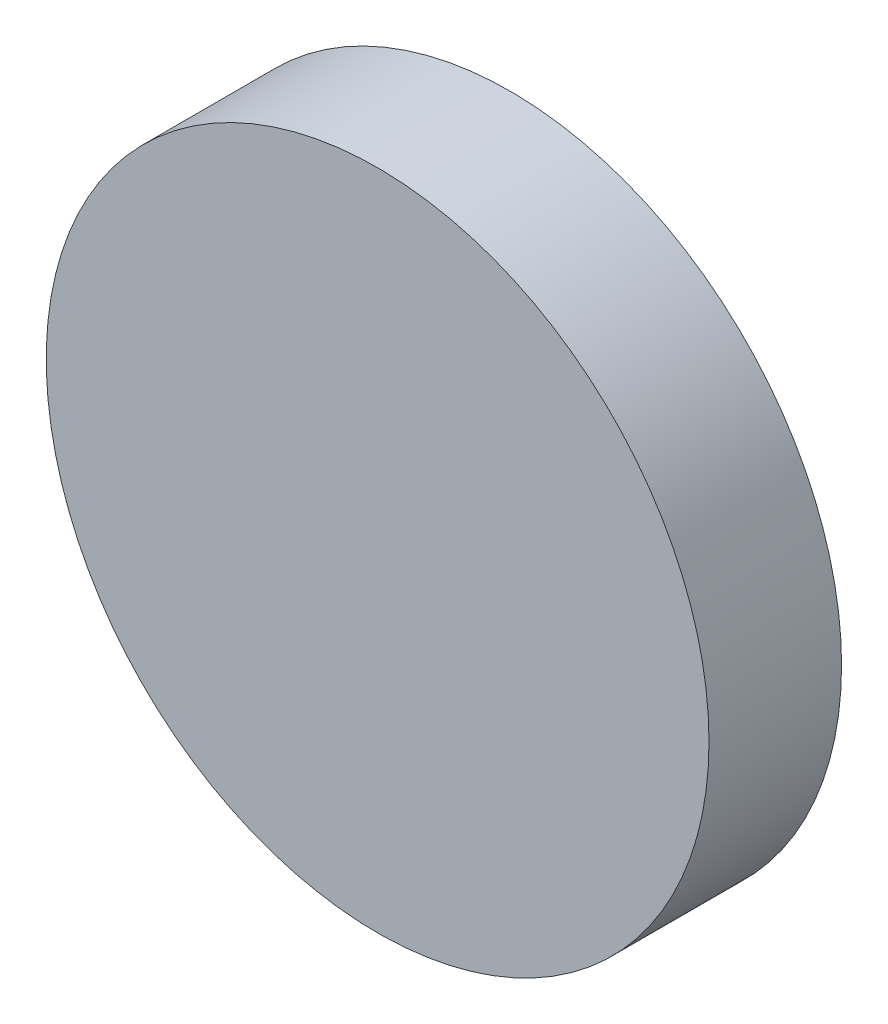
ISO-10303-21;
HEADER;
FILE_DESCRIPTION(('STEP AP214'),'2;1');
FILE_NAME('part.step','',(''),(''),'','','');
FILE_SCHEMA(('AUTOMOTIVE_DESIGN { 1 0 10303 214 1 1 1 1 }'));
ENDSEC;
DATA;
#1=APPLICATION_CONTEXT('core data for automotive mechanical design processes');
#2=APPLICATION_PROTOCOL_DEFINITION('international standard','automotive_design',2000,#1);
#3=PRODUCT_CONTEXT('',#1,'mechanical');
#4=PRODUCT('Part','Part','',(#3));
#5=PRODUCT_RELATED_PRODUCT_CATEGORY('part','',(#4));
#6=PRODUCT_DEFINITION_FORMATION('','',#4);
#7=PRODUCT_DEFINITION_CONTEXT('part definition',#1,'design');
#8=PRODUCT_DEFINITION('design','',#6,#7);
#9=PRODUCT_DEFINITION_SHAPE('','',#8);
#10=(LENGTH_UNIT() NAMED_UNIT(*) SI_UNIT(.MILLI.,.METRE.));
#11=(NAMED_UNIT(*) PLANE_ANGLE_UNIT() SI_UNIT($,.RADIAN.));
#12=(NAMED_UNIT(*) SI_UNIT($,.STERADIAN.) SOLID_ANGLE_UNIT());
#13=UNCERTAINTY_MEASURE_WITH_UNIT(LENGTH_MEASURE(1.E-05),#10,'distance_accuracy_value','');
#14=(GEOMETRIC_REPRESENTATION_CONTEXT(3) GLOBAL_UNCERTAINTY_ASSIGNED_CONTEXT((#13)) GLOBAL_UNIT_ASSIGNED_CONTEXT((#10,
#11,#12)) REPRESENTATION_CONTEXT('',''));
#15=CARTESIAN_POINT('',(0.,0.,0.));
#16=DIRECTION('',(0.,0.,1.));
#17=DIRECTION('',(1.,0.,0.));
#18=AXIS2_PLACEMENT_3D('',#15,#16,#17);
#19=CARTESIAN_POINT('',(0.,0.,-161.42135623731));
#20=DIRECTION('',(0.,0.,1.));
#21=DIRECTION('',(1.,0.,0.));
#22=AXIS2_PLACEMENT_3D('',#19,#20,#21);
#23=CYLINDRICAL_SURFACE('',#22,50.);
#24=CARTESIAN_POINT('',(0.,0.,-20.));
#25=DIRECTION('',(0.,0.,1.));
#26=DIRECTION('',(1.,0.,0.));
#27=AXIS2_PLACEMENT_3D('',#24,#25,#26);
#28=CIRCLE('',#27,50.);
#29=CARTESIAN_POINT('',(50.,0.,-20.));
#30=VERTEX_POINT('',#29);
#31=EDGE_CURVE('E10',#30,#30,#28,.F.);
#32=ORIENTED_EDGE('',*,*,#31,.F.);
#33=EDGE_LOOP('',(#32));
#34=FACE_BOUND('',#33,.T.);
#35=CARTESIAN_POINT('',(0.,0.,0.));
#36=DIRECTION('',(0.,0.,1.));
#37=DIRECTION('',(1.,0.,0.));
#38=AXIS2_PLACEMENT_3D('',#35,#36,#37);
#39=CIRCLE('',#38,50.);
#40=CARTESIAN_POINT('',(50.,0.,0.));
#41=VERTEX_POINT('',#40);
#42=EDGE_CURVE('E37',#41,#41,#39,.T.);
#43=ORIENTED_EDGE('',*,*,#42,.F.);
#44=EDGE_LOOP('',(#43));
#45=FACE_BOUND('',#44,.T.);
#46=ADVANCED_FACE('F31',(#34,#45),#23,.T.);
#47=CARTESIAN_POINT('',(0.,0.,0.));
#48=DIRECTION('',(0.,0.,1.));
#49=DIRECTION('',(1.,0.,0.));
#50=AXIS2_PLACEMENT_3D('',#47,#48,#49);
#51=PLANE('',#50);
#52=ORIENTED_EDGE('',*,*,#42,.T.);
#53=EDGE_LOOP('',(#52));
#54=FACE_BOUND('',#53,.T.);
#55=ADVANCED_FACE('F43',(#54),#51,.T.);
#56=CARTESIAN_POINT('',(0.,0.,-20.));
#57=DIRECTION('',(0.,0.,1.));
#58=DIRECTION('',(1.,0.,0.));
#59=AXIS2_PLACEMENT_3D('',#56,#57,#58);
#60=PLANE('',#59);
#61=ORIENTED_EDGE('',*,*,#31,.T.);
#62=EDGE_LOOP('',(#61));
#63=FACE_BOUND('',#62,.T.);
#64=ADVANCED_FACE('F50',(#63),#60,.F.);
#65=CLOSED_SHELL('',(#46,#55,#64));
#66=MANIFOLD_SOLID_BREP('B2',#65);
#67=ADVANCED_BREP_SHAPE_REPRESENTATION('',(#18,#66),#14);
#68=SHAPE_DEFINITION_REPRESENTATION(#9,#67);
ENDSEC;
END-ISO-10303-21;
